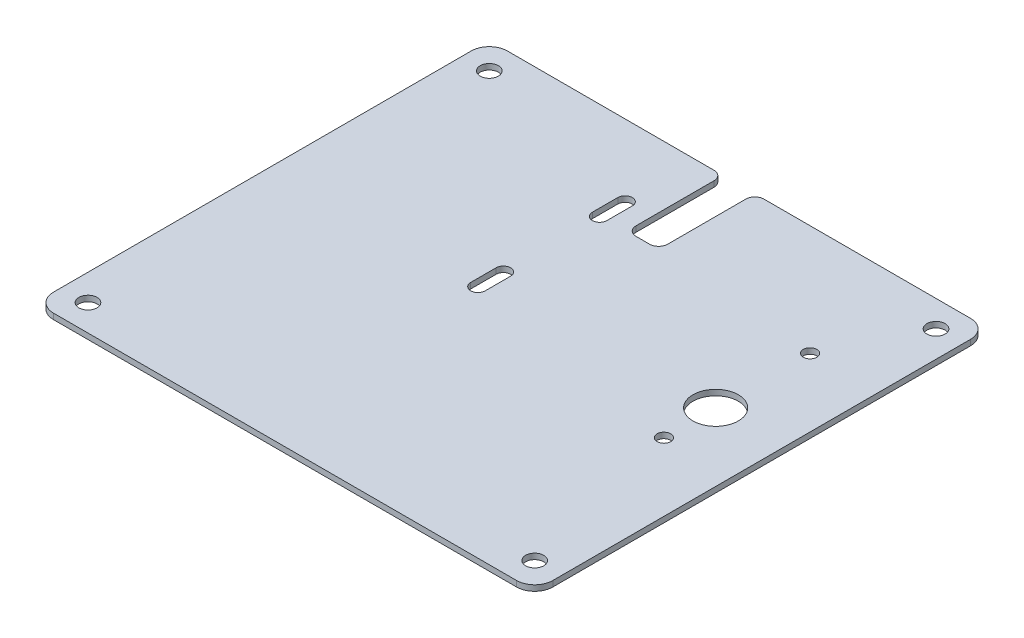
ISO-10303-21;
HEADER;
FILE_DESCRIPTION(('STEP AP214'),'2;1');
FILE_NAME('part.step','',(''),(''),'','','');
FILE_SCHEMA(('AUTOMOTIVE_DESIGN { 1 0 10303 214 1 1 1 1 }'));
ENDSEC;
DATA;
#1=APPLICATION_CONTEXT('core data for automotive mechanical design processes');
#2=APPLICATION_PROTOCOL_DEFINITION('international standard','automotive_design',2000,#1);
#3=PRODUCT_CONTEXT('',#1,'mechanical');
#4=PRODUCT('Part','Part','',(#3));
#5=PRODUCT_RELATED_PRODUCT_CATEGORY('part','',(#4));
#6=PRODUCT_DEFINITION_FORMATION('','',#4);
#7=PRODUCT_DEFINITION_CONTEXT('part definition',#1,'design');
#8=PRODUCT_DEFINITION('design','',#6,#7);
#9=PRODUCT_DEFINITION_SHAPE('','',#8);
#10=(LENGTH_UNIT() NAMED_UNIT(*) SI_UNIT(.MILLI.,.METRE.));
#11=(NAMED_UNIT(*) PLANE_ANGLE_UNIT() SI_UNIT($,.RADIAN.));
#12=(NAMED_UNIT(*) SI_UNIT($,.STERADIAN.) SOLID_ANGLE_UNIT());
#13=UNCERTAINTY_MEASURE_WITH_UNIT(LENGTH_MEASURE(1.E-05),#10,'distance_accuracy_value','');
#14=(GEOMETRIC_REPRESENTATION_CONTEXT(3) GLOBAL_UNCERTAINTY_ASSIGNED_CONTEXT((#13)) GLOBAL_UNIT_ASSIGNED_CONTEXT((#10,
#11,#12)) REPRESENTATION_CONTEXT('',''));
#15=CARTESIAN_POINT('',(0.,0.,0.));
#16=DIRECTION('',(0.,0.,1.));
#17=DIRECTION('',(1.,0.,0.));
#18=AXIS2_PLACEMENT_3D('',#15,#16,#17);
#19=CARTESIAN_POINT('',(-69.85,-1.5875,-63.5));
#20=DIRECTION('',(-1.,0.,0.));
#21=DIRECTION('',(0.,0.,1.));
#22=AXIS2_PLACEMENT_3D('',#19,#20,#21);
#23=PLANE('',#22);
#24=DIRECTION('',(0.,0.,1.));
#25=VECTOR('',#24,1.);
#26=CARTESIAN_POINT('',(-69.85,-1.5875,-63.5));
#27=LINE('',#26,#25);
#28=CARTESIAN_POINT('',(-69.85,-1.5875,-58.42));
#29=VERTEX_POINT('',#28);
#30=CARTESIAN_POINT('',(-69.85,-1.5875,58.42));
#31=VERTEX_POINT('',#30);
#32=EDGE_CURVE('E340',#29,#31,#27,.T.);
#33=ORIENTED_EDGE('',*,*,#32,.T.);
#34=DIRECTION('',(0.,1.,0.));
#35=VECTOR('',#34,1.);
#36=CARTESIAN_POINT('',(-69.85,-1.5875,58.42));
#37=LINE('',#36,#35);
#38=CARTESIAN_POINT('',(-69.85,0.,58.42));
#39=VERTEX_POINT('',#38);
#40=EDGE_CURVE('E403',#31,#39,#37,.T.);
#41=ORIENTED_EDGE('',*,*,#40,.T.);
#42=DIRECTION('',(0.,0.,1.));
#43=VECTOR('',#42,1.);
#44=CARTESIAN_POINT('',(-69.85,0.,-63.5));
#45=LINE('',#44,#43);
#46=CARTESIAN_POINT('',(-69.85,0.,-58.42));
#47=VERTEX_POINT('',#46);
#48=EDGE_CURVE('E336',#47,#39,#45,.T.);
#49=ORIENTED_EDGE('',*,*,#48,.F.);
#50=DIRECTION('',(0.,1.,0.));
#51=VECTOR('',#50,1.);
#52=CARTESIAN_POINT('',(-69.85,-1.5875,-58.42));
#53=LINE('',#52,#51);
#54=EDGE_CURVE('E372',#47,#29,#53,.F.);
#55=ORIENTED_EDGE('',*,*,#54,.T.);
#56=EDGE_LOOP('',(#33,#41,#49,#55));
#57=FACE_BOUND('',#56,.T.);
#58=ADVANCED_FACE('F43',(#57),#23,.T.);
#59=CARTESIAN_POINT('',(-4.445,-1.5875,-63.5000000000001));
#60=DIRECTION('',(0.,0.,-1.));
#61=DIRECTION('',(-1.,0.,0.));
#62=AXIS2_PLACEMENT_3D('',#59,#60,#61);
#63=PLANE('',#62);
#64=DIRECTION('',(-1.,0.,0.));
#65=VECTOR('',#64,1.);
#66=CARTESIAN_POINT('',(-4.445,0.,-63.5000000000001));
#67=LINE('',#66,#65);
#68=CARTESIAN_POINT('',(-6.985,0.,-63.5000000000001));
#69=VERTEX_POINT('',#68);
#70=CARTESIAN_POINT('',(-64.77,0.,-63.5));
#71=VERTEX_POINT('',#70);
#72=EDGE_CURVE('E345',#69,#71,#67,.T.);
#73=ORIENTED_EDGE('',*,*,#72,.F.);
#74=DIRECTION('',(0.,1.,0.));
#75=VECTOR('',#74,1.);
#76=CARTESIAN_POINT('',(-6.985,-1.5875,-63.5000000000001));
#77=LINE('',#76,#75);
#78=CARTESIAN_POINT('',(-6.985,-1.5875,-63.5000000000001));
#79=VERTEX_POINT('',#78);
#80=EDGE_CURVE('E59',#69,#79,#77,.F.);
#81=ORIENTED_EDGE('',*,*,#80,.T.);
#82=DIRECTION('',(-1.,0.,0.));
#83=VECTOR('',#82,1.);
#84=CARTESIAN_POINT('',(-4.445,-1.5875,-63.5000000000001));
#85=LINE('',#84,#83);
#86=CARTESIAN_POINT('',(-64.77,-1.5875,-63.5));
#87=VERTEX_POINT('',#86);
#88=EDGE_CURVE('E369',#79,#87,#85,.T.);
#89=ORIENTED_EDGE('',*,*,#88,.T.);
#90=DIRECTION('',(0.,1.,0.));
#91=VECTOR('',#90,1.);
#92=CARTESIAN_POINT('',(-64.77,-1.5875,-63.5));
#93=LINE('',#92,#91);
#94=EDGE_CURVE('E449',#87,#71,#93,.T.);
#95=ORIENTED_EDGE('',*,*,#94,.T.);
#96=EDGE_LOOP('',(#73,#81,#89,#95));
#97=FACE_BOUND('',#96,.T.);
#98=ADVANCED_FACE('F570',(#97),#63,.T.);
#99=CARTESIAN_POINT('',(-4.44499999999999,-1.5875,-36.5760000000001));
#100=DIRECTION('',(1.,0.,0.));
#101=DIRECTION('',(0.,0.,-1.));
#102=AXIS2_PLACEMENT_3D('',#99,#100,#101);
#103=PLANE('',#102);
#104=DIRECTION('',(0.,0.,-1.));
#105=VECTOR('',#104,1.);
#106=CARTESIAN_POINT('',(-4.44499999999999,0.,-36.5760000000001));
#107=LINE('',#106,#105);
#108=CARTESIAN_POINT('',(-4.445,0.,-39.1160000000001));
#109=VERTEX_POINT('',#108);
#110=CARTESIAN_POINT('',(-4.445,0.,-60.9600000000001));
#111=VERTEX_POINT('',#110);
#112=EDGE_CURVE('E396',#109,#111,#107,.T.);
#113=ORIENTED_EDGE('',*,*,#112,.F.);
#114=DIRECTION('',(0.,1.,0.));
#115=VECTOR('',#114,1.);
#116=CARTESIAN_POINT('',(-4.445,-1.5875,-39.1160000000001));
#117=LINE('',#116,#115);
#118=CARTESIAN_POINT('',(-4.445,-1.5875,-39.1160000000001));
#119=VERTEX_POINT('',#118);
#120=EDGE_CURVE('E471',#109,#119,#117,.F.);
#121=ORIENTED_EDGE('',*,*,#120,.T.);
#122=DIRECTION('',(0.,0.,-1.));
#123=VECTOR('',#122,1.);
#124=CARTESIAN_POINT('',(-4.44499999999999,-1.5875,-36.5760000000001));
#125=LINE('',#124,#123);
#126=CARTESIAN_POINT('',(-4.445,-1.5875,-60.9600000000001));
#127=VERTEX_POINT('',#126);
#128=EDGE_CURVE('E365',#119,#127,#125,.T.);
#129=ORIENTED_EDGE('',*,*,#128,.T.);
#130=DIRECTION('',(0.,1.,0.));
#131=VECTOR('',#130,1.);
#132=CARTESIAN_POINT('',(-4.445,-1.5875,-60.9600000000001));
#133=LINE('',#132,#131);
#134=EDGE_CURVE('E467',#127,#111,#133,.T.);
#135=ORIENTED_EDGE('',*,*,#134,.T.);
#136=EDGE_LOOP('',(#113,#121,#129,#135));
#137=FACE_BOUND('',#136,.T.);
#138=ADVANCED_FACE('F504',(#137),#103,.T.);
#139=CARTESIAN_POINT('',(4.445,-1.5875,-36.5760000000001));
#140=DIRECTION('',(0.,0.,-1.));
#141=DIRECTION('',(-1.,0.,0.));
#142=AXIS2_PLACEMENT_3D('',#139,#140,#141);
#143=PLANE('',#142);
#144=DIRECTION('',(-1.,0.,0.));
#145=VECTOR('',#144,1.);
#146=CARTESIAN_POINT('',(4.445,0.,-36.5760000000001));
#147=LINE('',#146,#145);
#148=CARTESIAN_POINT('',(1.905,0.,-36.5760000000001));
#149=VERTEX_POINT('',#148);
#150=CARTESIAN_POINT('',(-1.905,0.,-36.5760000000001));
#151=VERTEX_POINT('',#150);
#152=EDGE_CURVE('E392',#149,#151,#147,.T.);
#153=ORIENTED_EDGE('',*,*,#152,.F.);
#154=DIRECTION('',(0.,1.,0.));
#155=VECTOR('',#154,1.);
#156=CARTESIAN_POINT('',(1.905,-1.5875,-36.5760000000001));
#157=LINE('',#156,#155);
#158=CARTESIAN_POINT('',(1.905,-1.5875,-36.5760000000001));
#159=VERTEX_POINT('',#158);
#160=EDGE_CURVE('E464',#149,#159,#157,.F.);
#161=ORIENTED_EDGE('',*,*,#160,.T.);
#162=DIRECTION('',(-1.,0.,0.));
#163=VECTOR('',#162,1.);
#164=CARTESIAN_POINT('',(4.445,-1.5875,-36.5760000000001));
#165=LINE('',#164,#163);
#166=CARTESIAN_POINT('',(-1.905,-1.5875,-36.5760000000001));
#167=VERTEX_POINT('',#166);
#168=EDGE_CURVE('E361',#159,#167,#165,.T.);
#169=ORIENTED_EDGE('',*,*,#168,.T.);
#170=DIRECTION('',(0.,1.,0.));
#171=VECTOR('',#170,1.);
#172=CARTESIAN_POINT('',(-1.905,0.,-36.5760000000001));
#173=LINE('',#172,#171);
#174=EDGE_CURVE('E460',#167,#151,#173,.T.);
#175=ORIENTED_EDGE('',*,*,#174,.T.);
#176=EDGE_LOOP('',(#153,#161,#169,#175));
#177=FACE_BOUND('',#176,.T.);
#178=ADVANCED_FACE('F514',(#177),#143,.T.);
#179=CARTESIAN_POINT('',(4.445,-1.5875,-36.5760000000001));
#180=DIRECTION('',(-1.,0.,0.));
#181=DIRECTION('',(0.,0.,1.));
#182=AXIS2_PLACEMENT_3D('',#179,#180,#181);
#183=PLANE('',#182);
#184=DIRECTION('',(0.,0.,1.));
#185=VECTOR('',#184,1.);
#186=CARTESIAN_POINT('',(4.445,-1.5875,-36.5760000000001));
#187=LINE('',#186,#185);
#188=CARTESIAN_POINT('',(4.445,-1.5875,-60.96));
#189=VERTEX_POINT('',#188);
#190=CARTESIAN_POINT('',(4.445,-1.5875,-39.1160000000001));
#191=VERTEX_POINT('',#190);
#192=EDGE_CURVE('E357',#189,#191,#187,.T.);
#193=ORIENTED_EDGE('',*,*,#192,.T.);
#194=DIRECTION('',(0.,1.,0.));
#195=VECTOR('',#194,1.);
#196=CARTESIAN_POINT('',(4.445,0.,-39.1160000000001));
#197=LINE('',#196,#195);
#198=CARTESIAN_POINT('',(4.445,0.,-39.1160000000001));
#199=VERTEX_POINT('',#198);
#200=EDGE_CURVE('E456',#191,#199,#197,.T.);
#201=ORIENTED_EDGE('',*,*,#200,.T.);
#202=DIRECTION('',(0.,0.,1.));
#203=VECTOR('',#202,1.);
#204=CARTESIAN_POINT('',(4.445,0.,-36.5760000000001));
#205=LINE('',#204,#203);
#206=CARTESIAN_POINT('',(4.445,0.,-60.96));
#207=VERTEX_POINT('',#206);
#208=EDGE_CURVE('E388',#207,#199,#205,.T.);
#209=ORIENTED_EDGE('',*,*,#208,.F.);
#210=DIRECTION('',(0.,1.,0.));
#211=VECTOR('',#210,1.);
#212=CARTESIAN_POINT('',(4.445,-1.5875,-60.96));
#213=LINE('',#212,#211);
#214=EDGE_CURVE('E453',#207,#189,#213,.F.);
#215=ORIENTED_EDGE('',*,*,#214,.T.);
#216=EDGE_LOOP('',(#193,#201,#209,#215));
#217=FACE_BOUND('',#216,.T.);
#218=ADVANCED_FACE('F521',(#217),#183,.T.);
#219=CARTESIAN_POINT('',(69.85,-1.5875,-63.5));
#220=DIRECTION('',(0.,0.,-1.));
#221=DIRECTION('',(-1.,0.,0.));
#222=AXIS2_PLACEMENT_3D('',#219,#220,#221);
#223=PLANE('',#222);
#224=DIRECTION('',(-1.,0.,0.));
#225=VECTOR('',#224,1.);
#226=CARTESIAN_POINT('',(69.85,-1.5875,-63.5));
#227=LINE('',#226,#225);
#228=CARTESIAN_POINT('',(64.77,-1.5875,-63.5));
#229=VERTEX_POINT('',#228);
#230=CARTESIAN_POINT('',(6.985,-1.5875,-63.5));
#231=VERTEX_POINT('',#230);
#232=EDGE_CURVE('E353',#229,#231,#227,.T.);
#233=ORIENTED_EDGE('',*,*,#232,.T.);
#234=DIRECTION('',(0.,1.,0.));
#235=VECTOR('',#234,1.);
#236=CARTESIAN_POINT('',(6.985,-1.5875,-63.5));
#237=LINE('',#236,#235);
#238=CARTESIAN_POINT('',(6.985,0.,-63.5));
#239=VERTEX_POINT('',#238);
#240=EDGE_CURVE('E474',#231,#239,#237,.T.);
#241=ORIENTED_EDGE('',*,*,#240,.T.);
#242=DIRECTION('',(-1.,0.,0.));
#243=VECTOR('',#242,1.);
#244=CARTESIAN_POINT('',(69.85,0.,-63.5));
#245=LINE('',#244,#243);
#246=CARTESIAN_POINT('',(64.77,0.,-63.5));
#247=VERTEX_POINT('',#246);
#248=EDGE_CURVE('E384',#247,#239,#245,.T.);
#249=ORIENTED_EDGE('',*,*,#248,.F.);
#250=DIRECTION('',(0.,1.,0.));
#251=VECTOR('',#250,1.);
#252=CARTESIAN_POINT('',(64.77,-1.5875,-63.5));
#253=LINE('',#252,#251);
#254=EDGE_CURVE('E446',#247,#229,#253,.F.);
#255=ORIENTED_EDGE('',*,*,#254,.T.);
#256=EDGE_LOOP('',(#233,#241,#249,#255));
#257=FACE_BOUND('',#256,.T.);
#258=ADVANCED_FACE('F530',(#257),#223,.T.);
#259=CARTESIAN_POINT('',(69.85,-1.5875,-63.5));
#260=DIRECTION('',(1.,0.,0.));
#261=DIRECTION('',(0.,0.,-1.));
#262=AXIS2_PLACEMENT_3D('',#259,#260,#261);
#263=PLANE('',#262);
#264=DIRECTION('',(0.,0.,-1.));
#265=VECTOR('',#264,1.);
#266=CARTESIAN_POINT('',(69.85,0.,-63.5));
#267=LINE('',#266,#265);
#268=CARTESIAN_POINT('',(69.85,0.,58.42));
#269=VERTEX_POINT('',#268);
#270=CARTESIAN_POINT('',(69.85,0.,-58.42));
#271=VERTEX_POINT('',#270);
#272=EDGE_CURVE('E380',#269,#271,#267,.T.);
#273=ORIENTED_EDGE('',*,*,#272,.F.);
#274=DIRECTION('',(0.,1.,0.));
#275=VECTOR('',#274,1.);
#276=CARTESIAN_POINT('',(69.85,-1.5875,58.42));
#277=LINE('',#276,#275);
#278=CARTESIAN_POINT('',(69.85,-1.5875,58.42));
#279=VERTEX_POINT('',#278);
#280=EDGE_CURVE('E443',#269,#279,#277,.F.);
#281=ORIENTED_EDGE('',*,*,#280,.T.);
#282=DIRECTION('',(0.,0.,-1.));
#283=VECTOR('',#282,1.);
#284=CARTESIAN_POINT('',(69.85,-1.5875,-63.5));
#285=LINE('',#284,#283);
#286=CARTESIAN_POINT('',(69.85,-1.5875,-58.42));
#287=VERTEX_POINT('',#286);
#288=EDGE_CURVE('E349',#279,#287,#285,.T.);
#289=ORIENTED_EDGE('',*,*,#288,.T.);
#290=DIRECTION('',(0.,1.,0.));
#291=VECTOR('',#290,1.);
#292=CARTESIAN_POINT('',(69.85,-1.5875,-58.42));
#293=LINE('',#292,#291);
#294=EDGE_CURVE('E439',#287,#271,#293,.T.);
#295=ORIENTED_EDGE('',*,*,#294,.T.);
#296=EDGE_LOOP('',(#273,#281,#289,#295));
#297=FACE_BOUND('',#296,.T.);
#298=ADVANCED_FACE('F540',(#297),#263,.T.);
#299=CARTESIAN_POINT('',(69.85,-1.5875,63.5));
#300=DIRECTION('',(0.,0.,1.));
#301=DIRECTION('',(1.,0.,0.));
#302=AXIS2_PLACEMENT_3D('',#299,#300,#301);
#303=PLANE('',#302);
#304=DIRECTION('',(1.,0.,0.));
#305=VECTOR('',#304,1.);
#306=CARTESIAN_POINT('',(69.85,0.,63.5));
#307=LINE('',#306,#305);
#308=CARTESIAN_POINT('',(-64.77,0.,63.5));
#309=VERTEX_POINT('',#308);
#310=CARTESIAN_POINT('',(64.77,0.,63.5));
#311=VERTEX_POINT('',#310);
#312=EDGE_CURVE('E376',#309,#311,#307,.T.);
#313=ORIENTED_EDGE('',*,*,#312,.F.);
#314=DIRECTION('',(0.,1.,0.));
#315=VECTOR('',#314,1.);
#316=CARTESIAN_POINT('',(-64.77,-1.5875,63.5));
#317=LINE('',#316,#315);
#318=CARTESIAN_POINT('',(-64.77,-1.5875,63.5));
#319=VERTEX_POINT('',#318);
#320=EDGE_CURVE('E423',#309,#319,#317,.F.);
#321=ORIENTED_EDGE('',*,*,#320,.T.);
#322=DIRECTION('',(1.,0.,0.));
#323=VECTOR('',#322,1.);
#324=CARTESIAN_POINT('',(69.85,-1.5875,63.5));
#325=LINE('',#324,#323);
#326=CARTESIAN_POINT('',(64.77,-1.5875,63.5));
#327=VERTEX_POINT('',#326);
#328=EDGE_CURVE('E344',#319,#327,#325,.T.);
#329=ORIENTED_EDGE('',*,*,#328,.T.);
#330=DIRECTION('',(0.,1.,0.));
#331=VECTOR('',#330,1.);
#332=CARTESIAN_POINT('',(64.77,-1.5875,63.5));
#333=LINE('',#332,#331);
#334=EDGE_CURVE('E419',#327,#311,#333,.T.);
#335=ORIENTED_EDGE('',*,*,#334,.T.);
#336=EDGE_LOOP('',(#313,#321,#329,#335));
#337=FACE_BOUND('',#336,.T.);
#338=ADVANCED_FACE('F549',(#337),#303,.T.);
#339=CARTESIAN_POINT('',(0.,-1.5875,0.));
#340=DIRECTION('',(0.,-1.,0.));
#341=DIRECTION('',(0.,0.,-1.));
#342=AXIS2_PLACEMENT_3D('',#339,#340,#341);
#343=PLANE('',#342);
#344=CARTESIAN_POINT('',(50.8,-1.5875,-6.17399411273837));
#345=DIRECTION('',(0.,1.,0.));
#346=DIRECTION('',(0.,0.,1.));
#347=AXIS2_PLACEMENT_3D('',#344,#345,#346);
#348=CIRCLE('',#347,6.35000000000001);
#349=CARTESIAN_POINT('',(50.8,-1.5875,0.176005887261636));
#350=VERTEX_POINT('',#349);
#351=EDGE_CURVE('E925',#350,#350,#348,.T.);
#352=ORIENTED_EDGE('',*,*,#351,.T.);
#353=EDGE_LOOP('',(#352));
#354=FACE_BOUND('',#353,.T.);
#355=CARTESIAN_POINT('',(50.8,-1.5875,-32.5899941127384));
#356=DIRECTION('',(0.,1.,0.));
#357=DIRECTION('',(0.,0.,1.));
#358=AXIS2_PLACEMENT_3D('',#355,#356,#357);
#359=CIRCLE('',#358,1.905);
#360=CARTESIAN_POINT('',(50.8,-1.5875,-30.6849941127384));
#361=VERTEX_POINT('',#360);
#362=EDGE_CURVE('E929',#361,#361,#359,.T.);
#363=ORIENTED_EDGE('',*,*,#362,.T.);
#364=EDGE_LOOP('',(#363));
#365=FACE_BOUND('',#364,.T.);
#366=CARTESIAN_POINT('',(50.8,-1.5875,8.30400588726162));
#367=DIRECTION('',(0.,1.,0.));
#368=DIRECTION('',(0.,0.,1.));
#369=AXIS2_PLACEMENT_3D('',#366,#367,#368);
#370=CIRCLE('',#369,1.905);
#371=CARTESIAN_POINT('',(50.8,-1.5875,10.2090058872616));
#372=VERTEX_POINT('',#371);
#373=EDGE_CURVE('E249',#372,#372,#370,.T.);
#374=ORIENTED_EDGE('',*,*,#373,.T.);
#375=EDGE_LOOP('',(#374));
#376=FACE_BOUND('',#375,.T.);
#377=CARTESIAN_POINT('',(-11.811,-1.5875,-9.39800000000005));
#378=DIRECTION('',(0.,1.,0.));
#379=DIRECTION('',(0.,0.,1.));
#380=AXIS2_PLACEMENT_3D('',#377,#378,#379);
#381=CIRCLE('',#380,2.032);
#382=CARTESIAN_POINT('',(-9.77899999999999,-1.5875,-9.39800000000005));
#383=VERTEX_POINT('',#382);
#384=CARTESIAN_POINT('',(-13.843,-1.5875,-9.39800000000005));
#385=VERTEX_POINT('',#384);
#386=EDGE_CURVE('E208',#383,#385,#381,.T.);
#387=ORIENTED_EDGE('',*,*,#386,.T.);
#388=DIRECTION('',(0.,0.,1.));
#389=VECTOR('',#388,1.);
#390=CARTESIAN_POINT('',(-13.843,-1.5875,-9.39800000000005));
#391=LINE('',#390,#389);
#392=CARTESIAN_POINT('',(-13.843,-1.5875,-2.28600000000005));
#393=VERTEX_POINT('',#392);
#394=EDGE_CURVE('E221',#385,#393,#391,.T.);
#395=ORIENTED_EDGE('',*,*,#394,.T.);
#396=CARTESIAN_POINT('',(-11.811,-1.5875,-2.28600000000005));
#397=DIRECTION('',(0.,1.,0.));
#398=DIRECTION('',(0.,0.,1.));
#399=AXIS2_PLACEMENT_3D('',#396,#397,#398);
#400=CIRCLE('',#399,2.032);
#401=CARTESIAN_POINT('',(-9.77899999999999,-1.5875,-2.28600000000005));
#402=VERTEX_POINT('',#401);
#403=EDGE_CURVE('E226',#393,#402,#400,.T.);
#404=ORIENTED_EDGE('',*,*,#403,.T.);
#405=DIRECTION('',(0.,0.,-1.));
#406=VECTOR('',#405,1.);
#407=CARTESIAN_POINT('',(-9.77899999999999,-1.5875,-9.39800000000005));
#408=LINE('',#407,#406);
#409=EDGE_CURVE('E217',#402,#383,#408,.T.);
#410=ORIENTED_EDGE('',*,*,#409,.T.);
#411=EDGE_LOOP('',(#387,#395,#404,#410));
#412=FACE_BOUND('',#411,.T.);
#413=CARTESIAN_POINT('',(-11.811,-1.5875,-43.4340000000001));
#414=DIRECTION('',(0.,1.,0.));
#415=DIRECTION('',(0.,0.,1.));
#416=AXIS2_PLACEMENT_3D('',#413,#414,#415);
#417=CIRCLE('',#416,2.032);
#418=CARTESIAN_POINT('',(-9.779,-1.5875,-43.4340000000001));
#419=VERTEX_POINT('',#418);
#420=CARTESIAN_POINT('',(-13.843,-1.5875,-43.4340000000001));
#421=VERTEX_POINT('',#420);
#422=EDGE_CURVE('E264',#419,#421,#417,.T.);
#423=ORIENTED_EDGE('',*,*,#422,.T.);
#424=DIRECTION('',(0.,0.,1.));
#425=VECTOR('',#424,1.);
#426=CARTESIAN_POINT('',(-13.843,-1.5875,-43.4340000000001));
#427=LINE('',#426,#425);
#428=CARTESIAN_POINT('',(-13.843,-1.5875,-36.3220000000001));
#429=VERTEX_POINT('',#428);
#430=EDGE_CURVE('E268',#421,#429,#427,.T.);
#431=ORIENTED_EDGE('',*,*,#430,.T.);
#432=CARTESIAN_POINT('',(-11.811,-1.5875,-36.3220000000001));
#433=DIRECTION('',(0.,1.,0.));
#434=DIRECTION('',(0.,0.,1.));
#435=AXIS2_PLACEMENT_3D('',#432,#433,#434);
#436=CIRCLE('',#435,2.032);
#437=CARTESIAN_POINT('',(-9.779,-1.5875,-36.3220000000001));
#438=VERTEX_POINT('',#437);
#439=EDGE_CURVE('E273',#429,#438,#436,.T.);
#440=ORIENTED_EDGE('',*,*,#439,.T.);
#441=DIRECTION('',(0.,0.,-1.));
#442=VECTOR('',#441,1.);
#443=CARTESIAN_POINT('',(-9.779,-1.5875,-43.4340000000001));
#444=LINE('',#443,#442);
#445=EDGE_CURVE('E277',#438,#419,#444,.T.);
#446=ORIENTED_EDGE('',*,*,#445,.T.);
#447=EDGE_LOOP('',(#423,#431,#440,#446));
#448=FACE_BOUND('',#447,.T.);
#449=CARTESIAN_POINT('',(62.484,-1.5875,56.134));
#450=DIRECTION('',(0.,1.,0.));
#451=DIRECTION('',(0.,0.,1.));
#452=AXIS2_PLACEMENT_3D('',#449,#450,#451);
#453=CIRCLE('',#452,2.53999999999999);
#454=CARTESIAN_POINT('',(62.484,-1.5875,58.674));
#455=VERTEX_POINT('',#454);
#456=EDGE_CURVE('E308',#455,#455,#453,.T.);
#457=ORIENTED_EDGE('',*,*,#456,.T.);
#458=EDGE_LOOP('',(#457));
#459=FACE_BOUND('',#458,.T.);
#460=CARTESIAN_POINT('',(62.484,-1.5875,-56.134));
#461=DIRECTION('',(0.,1.,0.));
#462=DIRECTION('',(0.,0.,1.));
#463=AXIS2_PLACEMENT_3D('',#460,#461,#462);
#464=CIRCLE('',#463,2.53999999999999);
#465=CARTESIAN_POINT('',(62.484,-1.5875,-53.5940000000001));
#466=VERTEX_POINT('',#465);
#467=EDGE_CURVE('E316',#466,#466,#464,.T.);
#468=ORIENTED_EDGE('',*,*,#467,.T.);
#469=EDGE_LOOP('',(#468));
#470=FACE_BOUND('',#469,.T.);
#471=CARTESIAN_POINT('',(-62.484,-1.5875,56.134));
#472=DIRECTION('',(0.,1.,0.));
#473=DIRECTION('',(0.,0.,1.));
#474=AXIS2_PLACEMENT_3D('',#471,#472,#473);
#475=CIRCLE('',#474,2.54);
#476=CARTESIAN_POINT('',(-62.484,-1.5875,58.674));
#477=VERTEX_POINT('',#476);
#478=EDGE_CURVE('E324',#477,#477,#475,.T.);
#479=ORIENTED_EDGE('',*,*,#478,.T.);
#480=EDGE_LOOP('',(#479));
#481=FACE_BOUND('',#480,.T.);
#482=CARTESIAN_POINT('',(-62.484,-1.5875,-56.134));
#483=DIRECTION('',(0.,1.,0.));
#484=DIRECTION('',(0.,0.,1.));
#485=AXIS2_PLACEMENT_3D('',#482,#483,#484);
#486=CIRCLE('',#485,2.54);
#487=CARTESIAN_POINT('',(-62.484,-1.5875,-53.594));
#488=VERTEX_POINT('',#487);
#489=EDGE_CURVE('E332',#488,#488,#486,.T.);
#490=ORIENTED_EDGE('',*,*,#489,.T.);
#491=EDGE_LOOP('',(#490));
#492=FACE_BOUND('',#491,.T.);
#493=ORIENTED_EDGE('',*,*,#192,.F.);
#494=CARTESIAN_POINT('',(6.985,-1.5875,-60.96));
#495=DIRECTION('',(0.,-1.,0.));
#496=DIRECTION('',(0.,0.,-1.));
#497=AXIS2_PLACEMENT_3D('',#494,#495,#496);
#498=CIRCLE('',#497,2.54);
#499=EDGE_CURVE('E486',#189,#231,#498,.T.);
#500=ORIENTED_EDGE('',*,*,#499,.T.);
#501=ORIENTED_EDGE('',*,*,#232,.F.);
#502=CARTESIAN_POINT('',(64.77,-1.5875,-58.42));
#503=DIRECTION('',(0.,-1.,0.));
#504=DIRECTION('',(0.,0.,-1.));
#505=AXIS2_PLACEMENT_3D('',#502,#503,#504);
#506=CIRCLE('',#505,5.08);
#507=EDGE_CURVE('E430',#229,#287,#506,.T.);
#508=ORIENTED_EDGE('',*,*,#507,.T.);
#509=ORIENTED_EDGE('',*,*,#288,.F.);
#510=CARTESIAN_POINT('',(64.77,-1.5875,58.42));
#511=DIRECTION('',(0.,-1.,0.));
#512=DIRECTION('',(0.,0.,-1.));
#513=AXIS2_PLACEMENT_3D('',#510,#511,#512);
#514=CIRCLE('',#513,5.08);
#515=EDGE_CURVE('E433',#279,#327,#514,.T.);
#516=ORIENTED_EDGE('',*,*,#515,.T.);
#517=ORIENTED_EDGE('',*,*,#328,.F.);
#518=CARTESIAN_POINT('',(-64.77,-1.5875,58.42));
#519=DIRECTION('',(0.,-1.,0.));
#520=DIRECTION('',(0.,0.,-1.));
#521=AXIS2_PLACEMENT_3D('',#518,#519,#520);
#522=CIRCLE('',#521,5.08);
#523=EDGE_CURVE('E436',#319,#31,#522,.T.);
#524=ORIENTED_EDGE('',*,*,#523,.T.);
#525=ORIENTED_EDGE('',*,*,#32,.F.);
#526=CARTESIAN_POINT('',(-64.77,-1.5875,-58.42));
#527=DIRECTION('',(0.,-1.,0.));
#528=DIRECTION('',(0.,0.,-1.));
#529=AXIS2_PLACEMENT_3D('',#526,#527,#528);
#530=CIRCLE('',#529,5.08);
#531=EDGE_CURVE('E426',#29,#87,#530,.T.);
#532=ORIENTED_EDGE('',*,*,#531,.T.);
#533=ORIENTED_EDGE('',*,*,#88,.F.);
#534=CARTESIAN_POINT('',(-6.985,-1.5875,-60.9600000000001));
#535=DIRECTION('',(0.,-1.,0.));
#536=DIRECTION('',(0.,0.,-1.));
#537=AXIS2_PLACEMENT_3D('',#534,#535,#536);
#538=CIRCLE('',#537,2.54);
#539=EDGE_CURVE('E483',#79,#127,#538,.T.);
#540=ORIENTED_EDGE('',*,*,#539,.T.);
#541=ORIENTED_EDGE('',*,*,#128,.F.);
#542=CARTESIAN_POINT('',(-1.905,-1.5875,-39.1160000000001));
#543=DIRECTION('',(0.,-1.,0.));
#544=DIRECTION('',(0.,0.,-1.));
#545=AXIS2_PLACEMENT_3D('',#542,#543,#544);
#546=CIRCLE('',#545,2.54);
#547=EDGE_CURVE('E11',#119,#167,#546,.F.);
#548=ORIENTED_EDGE('',*,*,#547,.T.);
#549=ORIENTED_EDGE('',*,*,#168,.F.);
#550=CARTESIAN_POINT('',(1.905,-1.5875,-39.1160000000001));
#551=DIRECTION('',(0.,-1.,0.));
#552=DIRECTION('',(0.,0.,-1.));
#553=AXIS2_PLACEMENT_3D('',#550,#551,#552);
#554=CIRCLE('',#553,2.54);
#555=EDGE_CURVE('E494',#159,#191,#554,.F.);
#556=ORIENTED_EDGE('',*,*,#555,.T.);
#557=EDGE_LOOP('',(#493,#500,#501,#508,#509,#516,#517,#524,#525,#532,#533,#540,#541,#548,#549,#556));
#558=FACE_BOUND('',#557,.T.);
#559=ADVANCED_FACE('F228',(#354,#365,#376,#412,#448,#459,#470,#481,#492,#558),#343,.T.);
#560=CARTESIAN_POINT('',(0.,0.,0.));
#561=DIRECTION('',(0.,-1.,0.));
#562=DIRECTION('',(0.,0.,-1.));
#563=AXIS2_PLACEMENT_3D('',#560,#561,#562);
#564=PLANE('',#563);
#565=CARTESIAN_POINT('',(50.8,0.,-6.17399411273837));
#566=DIRECTION('',(0.,1.,0.));
#567=DIRECTION('',(0.,0.,1.));
#568=AXIS2_PLACEMENT_3D('',#565,#566,#567);
#569=CIRCLE('',#568,6.35000000000001);
#570=CARTESIAN_POINT('',(50.8,0.,0.176005887261636));
#571=VERTEX_POINT('',#570);
#572=EDGE_CURVE('E942',#571,#571,#569,.T.);
#573=ORIENTED_EDGE('',*,*,#572,.F.);
#574=EDGE_LOOP('',(#573));
#575=FACE_BOUND('',#574,.T.);
#576=CARTESIAN_POINT('',(50.8,0.,-32.5899941127384));
#577=DIRECTION('',(0.,1.,0.));
#578=DIRECTION('',(0.,0.,1.));
#579=AXIS2_PLACEMENT_3D('',#576,#577,#578);
#580=CIRCLE('',#579,1.905);
#581=CARTESIAN_POINT('',(50.8,0.,-30.6849941127384));
#582=VERTEX_POINT('',#581);
#583=EDGE_CURVE('E936',#582,#582,#580,.T.);
#584=ORIENTED_EDGE('',*,*,#583,.F.);
#585=EDGE_LOOP('',(#584));
#586=FACE_BOUND('',#585,.T.);
#587=CARTESIAN_POINT('',(50.8,0.,8.30400588726162));
#588=DIRECTION('',(0.,1.,0.));
#589=DIRECTION('',(0.,0.,1.));
#590=AXIS2_PLACEMENT_3D('',#587,#588,#589);
#591=CIRCLE('',#590,1.905);
#592=CARTESIAN_POINT('',(50.8,0.,10.2090058872616));
#593=VERTEX_POINT('',#592);
#594=EDGE_CURVE('E239',#593,#593,#591,.T.);
#595=ORIENTED_EDGE('',*,*,#594,.F.);
#596=EDGE_LOOP('',(#595));
#597=FACE_BOUND('',#596,.T.);
#598=DIRECTION('',(0.,0.,1.));
#599=VECTOR('',#598,1.);
#600=CARTESIAN_POINT('',(-13.843,0.,-9.39800000000005));
#601=LINE('',#600,#599);
#602=CARTESIAN_POINT('',(-13.843,0.,-9.39800000000005));
#603=VERTEX_POINT('',#602);
#604=CARTESIAN_POINT('',(-13.843,0.,-2.28600000000005));
#605=VERTEX_POINT('',#604);
#606=EDGE_CURVE('E248',#603,#605,#601,.T.);
#607=ORIENTED_EDGE('',*,*,#606,.F.);
#608=CARTESIAN_POINT('',(-11.811,0.,-9.39800000000005));
#609=DIRECTION('',(0.,1.,0.));
#610=DIRECTION('',(0.,0.,1.));
#611=AXIS2_PLACEMENT_3D('',#608,#609,#610);
#612=CIRCLE('',#611,2.032);
#613=CARTESIAN_POINT('',(-9.77899999999999,0.,-9.39800000000005));
#614=VERTEX_POINT('',#613);
#615=EDGE_CURVE('E211',#614,#603,#612,.T.);
#616=ORIENTED_EDGE('',*,*,#615,.F.);
#617=DIRECTION('',(0.,0.,-1.));
#618=VECTOR('',#617,1.);
#619=CARTESIAN_POINT('',(-9.77899999999999,0.,-9.39800000000005));
#620=LINE('',#619,#618);
#621=CARTESIAN_POINT('',(-9.77899999999999,0.,-2.28600000000005));
#622=VERTEX_POINT('',#621);
#623=EDGE_CURVE('E232',#622,#614,#620,.T.);
#624=ORIENTED_EDGE('',*,*,#623,.F.);
#625=CARTESIAN_POINT('',(-11.811,0.,-2.28600000000005));
#626=DIRECTION('',(0.,1.,0.));
#627=DIRECTION('',(0.,0.,1.));
#628=AXIS2_PLACEMENT_3D('',#625,#626,#627);
#629=CIRCLE('',#628,2.032);
#630=EDGE_CURVE('E236',#605,#622,#629,.T.);
#631=ORIENTED_EDGE('',*,*,#630,.F.);
#632=EDGE_LOOP('',(#607,#616,#624,#631));
#633=FACE_BOUND('',#632,.T.);
#634=DIRECTION('',(0.,0.,1.));
#635=VECTOR('',#634,1.);
#636=CARTESIAN_POINT('',(-13.843,0.,-43.4340000000001));
#637=LINE('',#636,#635);
#638=CARTESIAN_POINT('',(-13.843,0.,-43.4340000000001));
#639=VERTEX_POINT('',#638);
#640=CARTESIAN_POINT('',(-13.843,0.,-36.3220000000001));
#641=VERTEX_POINT('',#640);
#642=EDGE_CURVE('E284',#639,#641,#637,.T.);
#643=ORIENTED_EDGE('',*,*,#642,.F.);
#644=CARTESIAN_POINT('',(-11.811,0.,-43.4340000000001));
#645=DIRECTION('',(0.,1.,0.));
#646=DIRECTION('',(0.,0.,1.));
#647=AXIS2_PLACEMENT_3D('',#644,#645,#646);
#648=CIRCLE('',#647,2.032);
#649=CARTESIAN_POINT('',(-9.779,0.,-43.4340000000001));
#650=VERTEX_POINT('',#649);
#651=EDGE_CURVE('E258',#650,#639,#648,.T.);
#652=ORIENTED_EDGE('',*,*,#651,.F.);
#653=DIRECTION('',(0.,0.,-1.));
#654=VECTOR('',#653,1.);
#655=CARTESIAN_POINT('',(-9.779,0.,-43.4340000000001));
#656=LINE('',#655,#654);
#657=CARTESIAN_POINT('',(-9.779,0.,-36.3220000000001));
#658=VERTEX_POINT('',#657);
#659=EDGE_CURVE('E269',#658,#650,#656,.T.);
#660=ORIENTED_EDGE('',*,*,#659,.F.);
#661=CARTESIAN_POINT('',(-11.811,0.,-36.3220000000001));
#662=DIRECTION('',(0.,1.,0.));
#663=DIRECTION('',(0.,0.,1.));
#664=AXIS2_PLACEMENT_3D('',#661,#662,#663);
#665=CIRCLE('',#664,2.032);
#666=EDGE_CURVE('E288',#641,#658,#665,.T.);
#667=ORIENTED_EDGE('',*,*,#666,.F.);
#668=EDGE_LOOP('',(#643,#652,#660,#667));
#669=FACE_BOUND('',#668,.T.);
#670=CARTESIAN_POINT('',(62.484,0.,56.134));
#671=DIRECTION('',(0.,1.,0.));
#672=DIRECTION('',(0.,0.,1.));
#673=AXIS2_PLACEMENT_3D('',#670,#671,#672);
#674=CIRCLE('',#673,2.53999999999999);
#675=CARTESIAN_POINT('',(62.484,0.,58.674));
#676=VERTEX_POINT('',#675);
#677=EDGE_CURVE('E298',#676,#676,#674,.T.);
#678=ORIENTED_EDGE('',*,*,#677,.F.);
#679=EDGE_LOOP('',(#678));
#680=FACE_BOUND('',#679,.T.);
#681=CARTESIAN_POINT('',(62.484,0.,-56.134));
#682=DIRECTION('',(0.,1.,0.));
#683=DIRECTION('',(0.,0.,1.));
#684=AXIS2_PLACEMENT_3D('',#681,#682,#683);
#685=CIRCLE('',#684,2.53999999999999);
#686=CARTESIAN_POINT('',(62.484,0.,-53.5940000000001));
#687=VERTEX_POINT('',#686);
#688=EDGE_CURVE('E312',#687,#687,#685,.T.);
#689=ORIENTED_EDGE('',*,*,#688,.F.);
#690=EDGE_LOOP('',(#689));
#691=FACE_BOUND('',#690,.T.);
#692=CARTESIAN_POINT('',(-62.484,0.,56.134));
#693=DIRECTION('',(0.,1.,0.));
#694=DIRECTION('',(0.,0.,1.));
#695=AXIS2_PLACEMENT_3D('',#692,#693,#694);
#696=CIRCLE('',#695,2.54);
#697=CARTESIAN_POINT('',(-62.484,0.,58.674));
#698=VERTEX_POINT('',#697);
#699=EDGE_CURVE('E320',#698,#698,#696,.T.);
#700=ORIENTED_EDGE('',*,*,#699,.F.);
#701=EDGE_LOOP('',(#700));
#702=FACE_BOUND('',#701,.T.);
#703=CARTESIAN_POINT('',(-62.484,0.,-56.134));
#704=DIRECTION('',(0.,1.,0.));
#705=DIRECTION('',(0.,0.,1.));
#706=AXIS2_PLACEMENT_3D('',#703,#704,#705);
#707=CIRCLE('',#706,2.54);
#708=CARTESIAN_POINT('',(-62.484,0.,-53.594));
#709=VERTEX_POINT('',#708);
#710=EDGE_CURVE('E328',#709,#709,#707,.T.);
#711=ORIENTED_EDGE('',*,*,#710,.F.);
#712=EDGE_LOOP('',(#711));
#713=FACE_BOUND('',#712,.T.);
#714=ORIENTED_EDGE('',*,*,#248,.T.);
#715=CARTESIAN_POINT('',(6.985,0.,-60.96));
#716=DIRECTION('',(0.,-1.,0.));
#717=DIRECTION('',(0.,0.,-1.));
#718=AXIS2_PLACEMENT_3D('',#715,#716,#717);
#719=CIRCLE('',#718,2.54);
#720=EDGE_CURVE('E480',#239,#207,#719,.F.);
#721=ORIENTED_EDGE('',*,*,#720,.T.);
#722=ORIENTED_EDGE('',*,*,#208,.T.);
#723=CARTESIAN_POINT('',(1.905,0.,-39.1160000000001));
#724=DIRECTION('',(0.,-1.,0.));
#725=DIRECTION('',(0.,0.,-1.));
#726=AXIS2_PLACEMENT_3D('',#723,#724,#725);
#727=CIRCLE('',#726,2.54);
#728=EDGE_CURVE('E491',#199,#149,#727,.T.);
#729=ORIENTED_EDGE('',*,*,#728,.T.);
#730=ORIENTED_EDGE('',*,*,#152,.T.);
#731=CARTESIAN_POINT('',(-1.905,0.,-39.1160000000001));
#732=DIRECTION('',(0.,-1.,0.));
#733=DIRECTION('',(0.,0.,-1.));
#734=AXIS2_PLACEMENT_3D('',#731,#732,#733);
#735=CIRCLE('',#734,2.54);
#736=EDGE_CURVE('E52',#151,#109,#735,.T.);
#737=ORIENTED_EDGE('',*,*,#736,.T.);
#738=ORIENTED_EDGE('',*,*,#112,.T.);
#739=CARTESIAN_POINT('',(-6.985,0.,-60.9600000000001));
#740=DIRECTION('',(0.,-1.,0.));
#741=DIRECTION('',(0.,0.,-1.));
#742=AXIS2_PLACEMENT_3D('',#739,#740,#741);
#743=CIRCLE('',#742,2.54);
#744=EDGE_CURVE('E67',#111,#69,#743,.F.);
#745=ORIENTED_EDGE('',*,*,#744,.T.);
#746=ORIENTED_EDGE('',*,*,#72,.T.);
#747=CARTESIAN_POINT('',(-64.77,0.,-58.42));
#748=DIRECTION('',(0.,-1.,0.));
#749=DIRECTION('',(0.,0.,-1.));
#750=AXIS2_PLACEMENT_3D('',#747,#748,#749);
#751=CIRCLE('',#750,5.08);
#752=EDGE_CURVE('E407',#71,#47,#751,.F.);
#753=ORIENTED_EDGE('',*,*,#752,.T.);
#754=ORIENTED_EDGE('',*,*,#48,.T.);
#755=CARTESIAN_POINT('',(-64.77,0.,58.42));
#756=DIRECTION('',(0.,-1.,0.));
#757=DIRECTION('',(0.,0.,-1.));
#758=AXIS2_PLACEMENT_3D('',#755,#756,#757);
#759=CIRCLE('',#758,5.08);
#760=EDGE_CURVE('E416',#39,#309,#759,.F.);
#761=ORIENTED_EDGE('',*,*,#760,.T.);
#762=ORIENTED_EDGE('',*,*,#312,.T.);
#763=CARTESIAN_POINT('',(64.77,0.,58.42));
#764=DIRECTION('',(0.,-1.,0.));
#765=DIRECTION('',(0.,0.,-1.));
#766=AXIS2_PLACEMENT_3D('',#763,#764,#765);
#767=CIRCLE('',#766,5.08);
#768=EDGE_CURVE('E413',#311,#269,#767,.F.);
#769=ORIENTED_EDGE('',*,*,#768,.T.);
#770=ORIENTED_EDGE('',*,*,#272,.T.);
#771=CARTESIAN_POINT('',(64.77,0.,-58.42));
#772=DIRECTION('',(0.,-1.,0.));
#773=DIRECTION('',(0.,0.,-1.));
#774=AXIS2_PLACEMENT_3D('',#771,#772,#773);
#775=CIRCLE('',#774,5.08);
#776=EDGE_CURVE('E410',#271,#247,#775,.F.);
#777=ORIENTED_EDGE('',*,*,#776,.T.);
#778=EDGE_LOOP('',(#714,#721,#722,#729,#730,#737,#738,#745,#746,#753,#754,#761,#762,#769,#770,#777));
#779=FACE_BOUND('',#778,.T.);
#780=ADVANCED_FACE('F498',(#575,#586,#597,#633,#669,#680,#691,#702,#713,#779),#564,.F.);
#781=CARTESIAN_POINT('',(-62.484,-1.5875,-56.134));
#782=DIRECTION('',(0.,1.,0.));
#783=DIRECTION('',(0.,0.,1.));
#784=AXIS2_PLACEMENT_3D('',#781,#782,#783);
#785=CYLINDRICAL_SURFACE('',#784,2.54);
#786=ORIENTED_EDGE('',*,*,#489,.F.);
#787=EDGE_LOOP('',(#786));
#788=FACE_BOUND('',#787,.T.);
#789=ORIENTED_EDGE('',*,*,#710,.T.);
#790=EDGE_LOOP('',(#789));
#791=FACE_BOUND('',#790,.T.);
#792=ADVANCED_FACE('F775',(#788,#791),#785,.F.);
#793=CARTESIAN_POINT('',(-62.484,-1.5875,56.134));
#794=DIRECTION('',(0.,1.,0.));
#795=DIRECTION('',(0.,0.,1.));
#796=AXIS2_PLACEMENT_3D('',#793,#794,#795);
#797=CYLINDRICAL_SURFACE('',#796,2.54);
#798=ORIENTED_EDGE('',*,*,#478,.F.);
#799=EDGE_LOOP('',(#798));
#800=FACE_BOUND('',#799,.T.);
#801=ORIENTED_EDGE('',*,*,#699,.T.);
#802=EDGE_LOOP('',(#801));
#803=FACE_BOUND('',#802,.T.);
#804=ADVANCED_FACE('F765',(#800,#803),#797,.F.);
#805=CARTESIAN_POINT('',(62.484,-1.5875,-56.134));
#806=DIRECTION('',(0.,1.,0.));
#807=DIRECTION('',(0.,0.,1.));
#808=AXIS2_PLACEMENT_3D('',#805,#806,#807);
#809=CYLINDRICAL_SURFACE('',#808,2.53999999999999);
#810=ORIENTED_EDGE('',*,*,#467,.F.);
#811=EDGE_LOOP('',(#810));
#812=FACE_BOUND('',#811,.T.);
#813=ORIENTED_EDGE('',*,*,#688,.T.);
#814=EDGE_LOOP('',(#813));
#815=FACE_BOUND('',#814,.T.);
#816=ADVANCED_FACE('F755',(#812,#815),#809,.F.);
#817=CARTESIAN_POINT('',(62.484,-1.5875,56.134));
#818=DIRECTION('',(0.,1.,0.));
#819=DIRECTION('',(0.,0.,1.));
#820=AXIS2_PLACEMENT_3D('',#817,#818,#819);
#821=CYLINDRICAL_SURFACE('',#820,2.53999999999999);
#822=ORIENTED_EDGE('',*,*,#456,.F.);
#823=EDGE_LOOP('',(#822));
#824=FACE_BOUND('',#823,.T.);
#825=ORIENTED_EDGE('',*,*,#677,.T.);
#826=EDGE_LOOP('',(#825));
#827=FACE_BOUND('',#826,.T.);
#828=ADVANCED_FACE('F745',(#824,#827),#821,.F.);
#829=CARTESIAN_POINT('',(-11.811,-1.5875,-43.4340000000001));
#830=DIRECTION('',(0.,1.,0.));
#831=DIRECTION('',(0.,0.,1.));
#832=AXIS2_PLACEMENT_3D('',#829,#830,#831);
#833=CYLINDRICAL_SURFACE('',#832,2.032);
#834=ORIENTED_EDGE('',*,*,#651,.T.);
#835=DIRECTION('',(0.,1.,0.));
#836=VECTOR('',#835,1.);
#837=CARTESIAN_POINT('',(-13.843,-1.5875,-43.4340000000001));
#838=LINE('',#837,#836);
#839=EDGE_CURVE('E281',#421,#639,#838,.T.);
#840=ORIENTED_EDGE('',*,*,#839,.F.);
#841=ORIENTED_EDGE('',*,*,#422,.F.);
#842=DIRECTION('',(0.,1.,0.));
#843=VECTOR('',#842,1.);
#844=CARTESIAN_POINT('',(-9.779,-1.5875,-43.4340000000001));
#845=LINE('',#844,#843);
#846=EDGE_CURVE('E295',#419,#650,#845,.T.);
#847=ORIENTED_EDGE('',*,*,#846,.T.);
#848=EDGE_LOOP('',(#834,#840,#841,#847));
#849=FACE_BOUND('',#848,.T.);
#850=ADVANCED_FACE('F735',(#849),#833,.F.);
#851=CARTESIAN_POINT('',(-9.779,-1.5875,-43.4340000000001));
#852=DIRECTION('',(1.,0.,0.));
#853=DIRECTION('',(0.,0.,-1.));
#854=AXIS2_PLACEMENT_3D('',#851,#852,#853);
#855=PLANE('',#854);
#856=ORIENTED_EDGE('',*,*,#659,.T.);
#857=ORIENTED_EDGE('',*,*,#846,.F.);
#858=ORIENTED_EDGE('',*,*,#445,.F.);
#859=DIRECTION('',(0.,1.,0.));
#860=VECTOR('',#859,1.);
#861=CARTESIAN_POINT('',(-9.779,-1.5875,-36.3220000000001));
#862=LINE('',#861,#860);
#863=EDGE_CURVE('E299',#438,#658,#862,.T.);
#864=ORIENTED_EDGE('',*,*,#863,.T.);
#865=EDGE_LOOP('',(#856,#857,#858,#864));
#866=FACE_BOUND('',#865,.T.);
#867=ADVANCED_FACE('F725',(#866),#855,.F.);
#868=CARTESIAN_POINT('',(-11.811,-1.5875,-36.3220000000001));
#869=DIRECTION('',(0.,1.,0.));
#870=DIRECTION('',(0.,0.,1.));
#871=AXIS2_PLACEMENT_3D('',#868,#869,#870);
#872=CYLINDRICAL_SURFACE('',#871,2.032);
#873=ORIENTED_EDGE('',*,*,#666,.T.);
#874=ORIENTED_EDGE('',*,*,#863,.F.);
#875=ORIENTED_EDGE('',*,*,#439,.F.);
#876=DIRECTION('',(0.,1.,0.));
#877=VECTOR('',#876,1.);
#878=CARTESIAN_POINT('',(-13.843,-1.5875,-36.3220000000001));
#879=LINE('',#878,#877);
#880=EDGE_CURVE('E302',#429,#641,#879,.T.);
#881=ORIENTED_EDGE('',*,*,#880,.T.);
#882=EDGE_LOOP('',(#873,#874,#875,#881));
#883=FACE_BOUND('',#882,.T.);
#884=ADVANCED_FACE('F715',(#883),#872,.F.);
#885=CARTESIAN_POINT('',(-13.843,-1.5875,-43.4340000000001));
#886=DIRECTION('',(-1.,0.,0.));
#887=DIRECTION('',(0.,0.,1.));
#888=AXIS2_PLACEMENT_3D('',#885,#886,#887);
#889=PLANE('',#888);
#890=ORIENTED_EDGE('',*,*,#642,.T.);
#891=ORIENTED_EDGE('',*,*,#880,.F.);
#892=ORIENTED_EDGE('',*,*,#430,.F.);
#893=ORIENTED_EDGE('',*,*,#839,.T.);
#894=EDGE_LOOP('',(#890,#891,#892,#893));
#895=FACE_BOUND('',#894,.T.);
#896=ADVANCED_FACE('F706',(#895),#889,.F.);
#897=CARTESIAN_POINT('',(-11.811,-1.5875,-9.39800000000005));
#898=DIRECTION('',(0.,1.,0.));
#899=DIRECTION('',(0.,0.,1.));
#900=AXIS2_PLACEMENT_3D('',#897,#898,#899);
#901=CYLINDRICAL_SURFACE('',#900,2.032);
#902=ORIENTED_EDGE('',*,*,#615,.T.);
#903=DIRECTION('',(0.,1.,0.));
#904=VECTOR('',#903,1.);
#905=CARTESIAN_POINT('',(-13.843,-1.5875,-9.39800000000005));
#906=LINE('',#905,#904);
#907=EDGE_CURVE('E204',#385,#603,#906,.T.);
#908=ORIENTED_EDGE('',*,*,#907,.F.);
#909=ORIENTED_EDGE('',*,*,#386,.F.);
#910=DIRECTION('',(0.,1.,0.));
#911=VECTOR('',#910,1.);
#912=CARTESIAN_POINT('',(-9.77899999999999,-1.5875,-9.39800000000005));
#913=LINE('',#912,#911);
#914=EDGE_CURVE('E255',#383,#614,#913,.T.);
#915=ORIENTED_EDGE('',*,*,#914,.T.);
#916=EDGE_LOOP('',(#902,#908,#909,#915));
#917=FACE_BOUND('',#916,.T.);
#918=ADVANCED_FACE('F206',(#917),#901,.F.);
#919=CARTESIAN_POINT('',(-9.77899999999999,-1.5875,-9.39800000000005));
#920=DIRECTION('',(1.,0.,0.));
#921=DIRECTION('',(0.,0.,-1.));
#922=AXIS2_PLACEMENT_3D('',#919,#920,#921);
#923=PLANE('',#922);
#924=ORIENTED_EDGE('',*,*,#623,.T.);
#925=ORIENTED_EDGE('',*,*,#914,.F.);
#926=ORIENTED_EDGE('',*,*,#409,.F.);
#927=DIRECTION('',(0.,1.,0.));
#928=VECTOR('',#927,1.);
#929=CARTESIAN_POINT('',(-9.77899999999999,-1.5875,-2.28600000000005));
#930=LINE('',#929,#928);
#931=EDGE_CURVE('E259',#402,#622,#930,.T.);
#932=ORIENTED_EDGE('',*,*,#931,.T.);
#933=EDGE_LOOP('',(#924,#925,#926,#932));
#934=FACE_BOUND('',#933,.T.);
#935=ADVANCED_FACE('F687',(#934),#923,.F.);
#936=CARTESIAN_POINT('',(-11.811,-1.5875,-2.28600000000005));
#937=DIRECTION('',(0.,1.,0.));
#938=DIRECTION('',(0.,0.,1.));
#939=AXIS2_PLACEMENT_3D('',#936,#937,#938);
#940=CYLINDRICAL_SURFACE('',#939,2.032);
#941=ORIENTED_EDGE('',*,*,#630,.T.);
#942=ORIENTED_EDGE('',*,*,#931,.F.);
#943=ORIENTED_EDGE('',*,*,#403,.F.);
#944=DIRECTION('',(0.,1.,0.));
#945=VECTOR('',#944,1.);
#946=CARTESIAN_POINT('',(-13.843,-1.5875,-2.28600000000005));
#947=LINE('',#946,#945);
#948=EDGE_CURVE('E216',#393,#605,#947,.T.);
#949=ORIENTED_EDGE('',*,*,#948,.T.);
#950=EDGE_LOOP('',(#941,#942,#943,#949));
#951=FACE_BOUND('',#950,.T.);
#952=ADVANCED_FACE('F678',(#951),#940,.F.);
#953=CARTESIAN_POINT('',(-13.843,-1.5875,-9.39800000000005));
#954=DIRECTION('',(-1.,0.,0.));
#955=DIRECTION('',(0.,0.,1.));
#956=AXIS2_PLACEMENT_3D('',#953,#954,#955);
#957=PLANE('',#956);
#958=ORIENTED_EDGE('',*,*,#606,.T.);
#959=ORIENTED_EDGE('',*,*,#948,.F.);
#960=ORIENTED_EDGE('',*,*,#394,.F.);
#961=ORIENTED_EDGE('',*,*,#907,.T.);
#962=EDGE_LOOP('',(#958,#959,#960,#961));
#963=FACE_BOUND('',#962,.T.);
#964=ADVANCED_FACE('F222',(#963),#957,.F.);
#965=CARTESIAN_POINT('',(50.8,-1.5875,8.30400588726162));
#966=DIRECTION('',(0.,1.,0.));
#967=DIRECTION('',(0.,0.,1.));
#968=AXIS2_PLACEMENT_3D('',#965,#966,#967);
#969=CYLINDRICAL_SURFACE('',#968,1.905);
#970=ORIENTED_EDGE('',*,*,#373,.F.);
#971=EDGE_LOOP('',(#970));
#972=FACE_BOUND('',#971,.T.);
#973=ORIENTED_EDGE('',*,*,#594,.T.);
#974=EDGE_LOOP('',(#973));
#975=FACE_BOUND('',#974,.T.);
#976=ADVANCED_FACE('F659',(#972,#975),#969,.F.);
#977=CARTESIAN_POINT('',(50.8,-1.5875,-32.5899941127384));
#978=DIRECTION('',(0.,1.,0.));
#979=DIRECTION('',(0.,0.,1.));
#980=AXIS2_PLACEMENT_3D('',#977,#978,#979);
#981=CYLINDRICAL_SURFACE('',#980,1.905);
#982=ORIENTED_EDGE('',*,*,#362,.F.);
#983=EDGE_LOOP('',(#982));
#984=FACE_BOUND('',#983,.T.);
#985=ORIENTED_EDGE('',*,*,#583,.T.);
#986=EDGE_LOOP('',(#985));
#987=FACE_BOUND('',#986,.T.);
#988=ADVANCED_FACE('F649',(#984,#987),#981,.F.);
#989=CARTESIAN_POINT('',(50.8,-1.5875,-6.17399411273837));
#990=DIRECTION('',(0.,1.,0.));
#991=DIRECTION('',(0.,0.,1.));
#992=AXIS2_PLACEMENT_3D('',#989,#990,#991);
#993=CYLINDRICAL_SURFACE('',#992,6.35000000000001);
#994=ORIENTED_EDGE('',*,*,#351,.F.);
#995=EDGE_LOOP('',(#994));
#996=FACE_BOUND('',#995,.T.);
#997=ORIENTED_EDGE('',*,*,#572,.T.);
#998=EDGE_LOOP('',(#997));
#999=FACE_BOUND('',#998,.T.);
#1000=ADVANCED_FACE('F581',(#996,#999),#993,.F.);
#1001=CARTESIAN_POINT('',(-64.77,-1.5875,58.42));
#1002=DIRECTION('',(0.,1.,0.));
#1003=DIRECTION('',(0.,0.,1.));
#1004=AXIS2_PLACEMENT_3D('',#1001,#1002,#1003);
#1005=CYLINDRICAL_SURFACE('',#1004,5.08);
#1006=ORIENTED_EDGE('',*,*,#523,.F.);
#1007=ORIENTED_EDGE('',*,*,#320,.F.);
#1008=ORIENTED_EDGE('',*,*,#760,.F.);
#1009=ORIENTED_EDGE('',*,*,#40,.F.);
#1010=EDGE_LOOP('',(#1006,#1007,#1008,#1009));
#1011=FACE_BOUND('',#1010,.T.);
#1012=ADVANCED_FACE('F552',(#1011),#1005,.T.);
#1013=CARTESIAN_POINT('',(64.77,-1.5875,58.42));
#1014=DIRECTION('',(0.,1.,0.));
#1015=DIRECTION('',(0.,0.,1.));
#1016=AXIS2_PLACEMENT_3D('',#1013,#1014,#1015);
#1017=CYLINDRICAL_SURFACE('',#1016,5.08);
#1018=ORIENTED_EDGE('',*,*,#515,.F.);
#1019=ORIENTED_EDGE('',*,*,#280,.F.);
#1020=ORIENTED_EDGE('',*,*,#768,.F.);
#1021=ORIENTED_EDGE('',*,*,#334,.F.);
#1022=EDGE_LOOP('',(#1018,#1019,#1020,#1021));
#1023=FACE_BOUND('',#1022,.T.);
#1024=ADVANCED_FACE('F543',(#1023),#1017,.T.);
#1025=CARTESIAN_POINT('',(64.77,-1.5875,-58.42));
#1026=DIRECTION('',(0.,1.,0.));
#1027=DIRECTION('',(0.,0.,1.));
#1028=AXIS2_PLACEMENT_3D('',#1025,#1026,#1027);
#1029=CYLINDRICAL_SURFACE('',#1028,5.08);
#1030=ORIENTED_EDGE('',*,*,#507,.F.);
#1031=ORIENTED_EDGE('',*,*,#254,.F.);
#1032=ORIENTED_EDGE('',*,*,#776,.F.);
#1033=ORIENTED_EDGE('',*,*,#294,.F.);
#1034=EDGE_LOOP('',(#1030,#1031,#1032,#1033));
#1035=FACE_BOUND('',#1034,.T.);
#1036=ADVANCED_FACE('F534',(#1035),#1029,.T.);
#1037=CARTESIAN_POINT('',(-64.77,-1.5875,-58.42));
#1038=DIRECTION('',(0.,1.,0.));
#1039=DIRECTION('',(0.,0.,1.));
#1040=AXIS2_PLACEMENT_3D('',#1037,#1038,#1039);
#1041=CYLINDRICAL_SURFACE('',#1040,5.08);
#1042=ORIENTED_EDGE('',*,*,#531,.F.);
#1043=ORIENTED_EDGE('',*,*,#54,.F.);
#1044=ORIENTED_EDGE('',*,*,#752,.F.);
#1045=ORIENTED_EDGE('',*,*,#94,.F.);
#1046=EDGE_LOOP('',(#1042,#1043,#1044,#1045));
#1047=FACE_BOUND('',#1046,.T.);
#1048=ADVANCED_FACE('F561',(#1047),#1041,.T.);
#1049=CARTESIAN_POINT('',(1.905,-1.5875,-39.1160000000001));
#1050=DIRECTION('',(0.,-1.,0.));
#1051=DIRECTION('',(0.,0.,-1.));
#1052=AXIS2_PLACEMENT_3D('',#1049,#1050,#1051);
#1053=CYLINDRICAL_SURFACE('',#1052,2.54);
#1054=ORIENTED_EDGE('',*,*,#555,.F.);
#1055=ORIENTED_EDGE('',*,*,#160,.F.);
#1056=ORIENTED_EDGE('',*,*,#728,.F.);
#1057=ORIENTED_EDGE('',*,*,#200,.F.);
#1058=EDGE_LOOP('',(#1054,#1055,#1056,#1057));
#1059=FACE_BOUND('',#1058,.T.);
#1060=ADVANCED_FACE('F517',(#1059),#1053,.F.);
#1061=CARTESIAN_POINT('',(-1.905,-1.5875,-39.1160000000001));
#1062=DIRECTION('',(0.,-1.,0.));
#1063=DIRECTION('',(0.,0.,-1.));
#1064=AXIS2_PLACEMENT_3D('',#1061,#1062,#1063);
#1065=CYLINDRICAL_SURFACE('',#1064,2.54);
#1066=ORIENTED_EDGE('',*,*,#547,.F.);
#1067=ORIENTED_EDGE('',*,*,#120,.F.);
#1068=ORIENTED_EDGE('',*,*,#736,.F.);
#1069=ORIENTED_EDGE('',*,*,#174,.F.);
#1070=EDGE_LOOP('',(#1066,#1067,#1068,#1069));
#1071=FACE_BOUND('',#1070,.T.);
#1072=ADVANCED_FACE('F508',(#1071),#1065,.F.);
#1073=CARTESIAN_POINT('',(6.985,-1.5875,-60.96));
#1074=DIRECTION('',(0.,1.,0.));
#1075=DIRECTION('',(0.,0.,1.));
#1076=AXIS2_PLACEMENT_3D('',#1073,#1074,#1075);
#1077=CYLINDRICAL_SURFACE('',#1076,2.54);
#1078=ORIENTED_EDGE('',*,*,#499,.F.);
#1079=ORIENTED_EDGE('',*,*,#214,.F.);
#1080=ORIENTED_EDGE('',*,*,#720,.F.);
#1081=ORIENTED_EDGE('',*,*,#240,.F.);
#1082=EDGE_LOOP('',(#1078,#1079,#1080,#1081));
#1083=FACE_BOUND('',#1082,.T.);
#1084=ADVANCED_FACE('F525',(#1083),#1077,.T.);
#1085=CARTESIAN_POINT('',(-6.985,-1.5875,-60.9600000000001));
#1086=DIRECTION('',(0.,1.,0.));
#1087=DIRECTION('',(0.,0.,1.));
#1088=AXIS2_PLACEMENT_3D('',#1085,#1086,#1087);
#1089=CYLINDRICAL_SURFACE('',#1088,2.54);
#1090=ORIENTED_EDGE('',*,*,#539,.F.);
#1091=ORIENTED_EDGE('',*,*,#80,.F.);
#1092=ORIENTED_EDGE('',*,*,#744,.F.);
#1093=ORIENTED_EDGE('',*,*,#134,.F.);
#1094=EDGE_LOOP('',(#1090,#1091,#1092,#1093));
#1095=FACE_BOUND('',#1094,.T.);
#1096=ADVANCED_FACE('F45',(#1095),#1089,.T.);
#1097=CLOSED_SHELL('',(#58,#98,#138,#178,#218,#258,#298,#338,#559,#780,#792,#804,#816,#828,#850,
#867,#884,#896,#918,#935,#952,#964,#976,#988,#1000,#1012,#1024,#1036,#1048,#1060,#1072,#1084,#1096));
#1098=MANIFOLD_SOLID_BREP('B2',#1097);
#1099=ADVANCED_BREP_SHAPE_REPRESENTATION('',(#18,#1098),#14);
#1100=SHAPE_DEFINITION_REPRESENTATION(#9,#1099);
ENDSEC;
END-ISO-10303-21;
